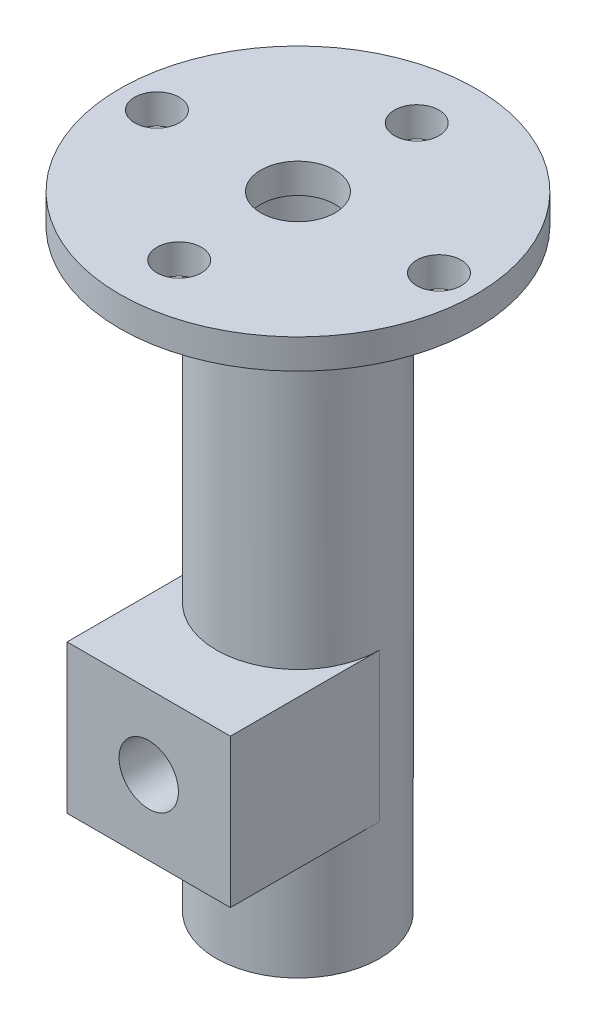
ISO-10303-21;
HEADER;
FILE_DESCRIPTION(('STEP AP214'),'2;1');
FILE_NAME('part.step','',(''),(''),'','','');
FILE_SCHEMA(('AUTOMOTIVE_DESIGN { 1 0 10303 214 1 1 1 1 }'));
ENDSEC;
DATA;
#1=APPLICATION_CONTEXT('core data for automotive mechanical design processes');
#2=APPLICATION_PROTOCOL_DEFINITION('international standard','automotive_design',2000,#1);
#3=PRODUCT_CONTEXT('',#1,'mechanical');
#4=PRODUCT('Part','Part','',(#3));
#5=PRODUCT_RELATED_PRODUCT_CATEGORY('part','',(#4));
#6=PRODUCT_DEFINITION_FORMATION('','',#4);
#7=PRODUCT_DEFINITION_CONTEXT('part definition',#1,'design');
#8=PRODUCT_DEFINITION('design','',#6,#7);
#9=PRODUCT_DEFINITION_SHAPE('','',#8);
#10=(LENGTH_UNIT() NAMED_UNIT(*) SI_UNIT(.MILLI.,.METRE.));
#11=(NAMED_UNIT(*) PLANE_ANGLE_UNIT() SI_UNIT($,.RADIAN.));
#12=(NAMED_UNIT(*) SI_UNIT($,.STERADIAN.) SOLID_ANGLE_UNIT());
#13=UNCERTAINTY_MEASURE_WITH_UNIT(LENGTH_MEASURE(1.E-05),#10,'distance_accuracy_value','');
#14=(GEOMETRIC_REPRESENTATION_CONTEXT(3) GLOBAL_UNCERTAINTY_ASSIGNED_CONTEXT((#13)) GLOBAL_UNIT_ASSIGNED_CONTEXT((#10,
#11,#12)) REPRESENTATION_CONTEXT('',''));
#15=CARTESIAN_POINT('',(0.,0.,0.));
#16=DIRECTION('',(0.,0.,1.));
#17=DIRECTION('',(1.,0.,0.));
#18=AXIS2_PLACEMENT_3D('',#15,#16,#17);
#19=CARTESIAN_POINT('',(0.,26.,0.));
#20=DIRECTION('',(0.,1.,0.));
#21=DIRECTION('',(0.,0.,1.));
#22=AXIS2_PLACEMENT_3D('',#19,#20,#21);
#23=PLANE('',#22);
#24=CARTESIAN_POINT('',(0.,26.,0.));
#25=DIRECTION('',(0.,-1.,0.));
#26=DIRECTION('',(0.,0.,-1.));
#27=AXIS2_PLACEMENT_3D('',#24,#25,#26);
#28=CIRCLE('',#27,2.5);
#29=CARTESIAN_POINT('',(0.,26.,-2.5));
#30=VERTEX_POINT('',#29);
#31=EDGE_CURVE('E162',#30,#30,#28,.T.);
#32=ORIENTED_EDGE('',*,*,#31,.F.);
#33=EDGE_LOOP('',(#32));
#34=FACE_BOUND('',#33,.T.);
#35=CARTESIAN_POINT('',(0.,26.,0.));
#36=DIRECTION('',(0.,-1.,0.));
#37=DIRECTION('',(0.,0.,-1.));
#38=AXIS2_PLACEMENT_3D('',#35,#36,#37);
#39=CIRCLE('',#38,4.05);
#40=CARTESIAN_POINT('',(0.,26.,-4.05));
#41=VERTEX_POINT('',#40);
#42=EDGE_CURVE('E147',#41,#41,#39,.T.);
#43=ORIENTED_EDGE('',*,*,#42,.T.);
#44=EDGE_LOOP('',(#43));
#45=FACE_BOUND('',#44,.T.);
#46=ADVANCED_FACE('F51',(#34,#45),#23,.F.);
#47=CARTESIAN_POINT('',(-9.5,26.,0.));
#48=DIRECTION('',(0.,-1.,0.));
#49=DIRECTION('',(0.,0.,-1.));
#50=AXIS2_PLACEMENT_3D('',#47,#48,#49);
#51=CIRCLE('',#50,1.5);
#52=CARTESIAN_POINT('',(-9.5,26.,-1.5));
#53=VERTEX_POINT('',#52);
#54=EDGE_CURVE('E175',#53,#53,#51,.F.);
#55=ORIENTED_EDGE('',*,*,#54,.T.);
#56=EDGE_LOOP('',(#55));
#57=FACE_BOUND('',#56,.T.);
#58=CARTESIAN_POINT('',(0.,26.,8.));
#59=DIRECTION('',(0.,-1.,0.));
#60=DIRECTION('',(0.,0.,-1.));
#61=AXIS2_PLACEMENT_3D('',#58,#59,#60);
#62=CIRCLE('',#61,1.5);
#63=CARTESIAN_POINT('',(0.,26.,6.5));
#64=VERTEX_POINT('',#63);
#65=EDGE_CURVE('E170',#64,#64,#62,.T.);
#66=ORIENTED_EDGE('',*,*,#65,.F.);
#67=CARTESIAN_POINT('',(0.,26.,0.));
#68=DIRECTION('',(0.,1.,0.));
#69=DIRECTION('',(0.,0.,1.));
#70=AXIS2_PLACEMENT_3D('',#67,#68,#69);
#71=CIRCLE('',#70,6.49999999999999);
#72=CARTESIAN_POINT('',(0.,26.,-6.5));
#73=VERTEX_POINT('',#72);
#74=EDGE_CURVE('E11',#64,#73,#71,.T.);
#75=ORIENTED_EDGE('',*,*,#74,.T.);
#76=CARTESIAN_POINT('',(0.,26.,-8.));
#77=DIRECTION('',(0.,-1.,0.));
#78=DIRECTION('',(0.,0.,-1.));
#79=AXIS2_PLACEMENT_3D('',#76,#77,#78);
#80=CIRCLE('',#79,1.5);
#81=EDGE_CURVE('E182',#73,#73,#80,.F.);
#82=ORIENTED_EDGE('',*,*,#81,.T.);
#83=CARTESIAN_POINT('',(0.,26.,0.));
#84=DIRECTION('',(0.,1.,0.));
#85=DIRECTION('',(0.,0.,1.));
#86=AXIS2_PLACEMENT_3D('',#83,#84,#85);
#87=CIRCLE('',#86,6.49999999999999);
#88=EDGE_CURVE('E61',#73,#64,#87,.T.);
#89=ORIENTED_EDGE('',*,*,#88,.T.);
#90=EDGE_LOOP('',(#66,#75,#82,#89));
#91=FACE_BOUND('',#90,.T.);
#92=CARTESIAN_POINT('',(9.5,26.,0.));
#93=DIRECTION('',(0.,-1.,0.));
#94=DIRECTION('',(0.,0.,-1.));
#95=AXIS2_PLACEMENT_3D('',#92,#93,#94);
#96=CIRCLE('',#95,1.5);
#97=CARTESIAN_POINT('',(9.5,26.,-1.5));
#98=VERTEX_POINT('',#97);
#99=EDGE_CURVE('E188',#98,#98,#96,.T.);
#100=ORIENTED_EDGE('',*,*,#99,.F.);
#101=EDGE_LOOP('',(#100));
#102=FACE_BOUND('',#101,.T.);
#103=CARTESIAN_POINT('',(0.,26.,0.));
#104=DIRECTION('',(0.,1.,0.));
#105=DIRECTION('',(0.,0.,1.));
#106=AXIS2_PLACEMENT_3D('',#103,#104,#105);
#107=CIRCLE('',#106,12.);
#108=CARTESIAN_POINT('',(0.,26.,12.));
#109=VERTEX_POINT('',#108);
#110=EDGE_CURVE('E158',#109,#109,#107,.T.);
#111=ORIENTED_EDGE('',*,*,#110,.F.);
#112=EDGE_LOOP('',(#111));
#113=FACE_BOUND('',#112,.T.);
#114=ADVANCED_FACE('F211',(#57,#91,#102,#113),#23,.F.);
#115=CARTESIAN_POINT('',(0.,28.,0.));
#116=DIRECTION('',(0.,1.,0.));
#117=DIRECTION('',(0.,0.,1.));
#118=AXIS2_PLACEMENT_3D('',#115,#116,#117);
#119=PLANE('',#118);
#120=CARTESIAN_POINT('',(-9.5,28.,0.));
#121=DIRECTION('',(0.,-1.,0.));
#122=DIRECTION('',(0.,0.,-1.));
#123=AXIS2_PLACEMENT_3D('',#120,#121,#122);
#124=CIRCLE('',#123,1.5);
#125=CARTESIAN_POINT('',(-9.5,28.,-1.5));
#126=VERTEX_POINT('',#125);
#127=EDGE_CURVE('E172',#126,#126,#124,.F.);
#128=ORIENTED_EDGE('',*,*,#127,.F.);
#129=EDGE_LOOP('',(#128));
#130=FACE_BOUND('',#129,.T.);
#131=CARTESIAN_POINT('',(9.5,28.,0.));
#132=DIRECTION('',(0.,-1.,0.));
#133=DIRECTION('',(0.,0.,-1.));
#134=AXIS2_PLACEMENT_3D('',#131,#132,#133);
#135=CIRCLE('',#134,1.5);
#136=CARTESIAN_POINT('',(9.5,28.,-1.5));
#137=VERTEX_POINT('',#136);
#138=EDGE_CURVE('E185',#137,#137,#135,.T.);
#139=ORIENTED_EDGE('',*,*,#138,.T.);
#140=EDGE_LOOP('',(#139));
#141=FACE_BOUND('',#140,.T.);
#142=CARTESIAN_POINT('',(0.,28.,-8.));
#143=DIRECTION('',(0.,-1.,0.));
#144=DIRECTION('',(0.,0.,-1.));
#145=AXIS2_PLACEMENT_3D('',#142,#143,#144);
#146=CIRCLE('',#145,1.5);
#147=CARTESIAN_POINT('',(0.,28.,-9.5));
#148=VERTEX_POINT('',#147);
#149=EDGE_CURVE('E178',#148,#148,#146,.F.);
#150=ORIENTED_EDGE('',*,*,#149,.F.);
#151=EDGE_LOOP('',(#150));
#152=FACE_BOUND('',#151,.T.);
#153=CARTESIAN_POINT('',(0.,28.,8.));
#154=DIRECTION('',(0.,-1.,0.));
#155=DIRECTION('',(0.,0.,-1.));
#156=AXIS2_PLACEMENT_3D('',#153,#154,#155);
#157=CIRCLE('',#156,1.5);
#158=CARTESIAN_POINT('',(0.,28.,6.5));
#159=VERTEX_POINT('',#158);
#160=EDGE_CURVE('E166',#159,#159,#157,.T.);
#161=ORIENTED_EDGE('',*,*,#160,.T.);
#162=EDGE_LOOP('',(#161));
#163=FACE_BOUND('',#162,.T.);
#164=CARTESIAN_POINT('',(0.,28.,0.));
#165=DIRECTION('',(0.,1.,0.));
#166=DIRECTION('',(0.,0.,1.));
#167=AXIS2_PLACEMENT_3D('',#164,#165,#166);
#168=CIRCLE('',#167,2.5);
#169=CARTESIAN_POINT('',(0.,28.,2.5));
#170=VERTEX_POINT('',#169);
#171=EDGE_CURVE('E165',#170,#170,#168,.T.);
#172=ORIENTED_EDGE('',*,*,#171,.F.);
#173=EDGE_LOOP('',(#172));
#174=FACE_BOUND('',#173,.T.);
#175=CARTESIAN_POINT('',(0.,28.,0.));
#176=DIRECTION('',(0.,1.,0.));
#177=DIRECTION('',(0.,0.,1.));
#178=AXIS2_PLACEMENT_3D('',#175,#176,#177);
#179=CIRCLE('',#178,12.);
#180=CARTESIAN_POINT('',(0.,28.,12.));
#181=VERTEX_POINT('',#180);
#182=EDGE_CURVE('E157',#181,#181,#179,.T.);
#183=ORIENTED_EDGE('',*,*,#182,.T.);
#184=EDGE_LOOP('',(#183));
#185=FACE_BOUND('',#184,.T.);
#186=ADVANCED_FACE('F218',(#130,#141,#152,#163,#174,#185),#119,.T.);
#187=CARTESIAN_POINT('',(9.5,28.,0.));
#188=DIRECTION('',(0.,-1.,0.));
#189=DIRECTION('',(0.,0.,-1.));
#190=AXIS2_PLACEMENT_3D('',#187,#188,#189);
#191=CYLINDRICAL_SURFACE('',#190,1.5);
#192=ORIENTED_EDGE('',*,*,#138,.F.);
#193=EDGE_LOOP('',(#192));
#194=FACE_BOUND('',#193,.T.);
#195=ORIENTED_EDGE('',*,*,#99,.T.);
#196=EDGE_LOOP('',(#195));
#197=FACE_BOUND('',#196,.T.);
#198=ADVANCED_FACE('F225',(#194,#197),#191,.F.);
#199=CARTESIAN_POINT('',(0.,28.,-8.));
#200=DIRECTION('',(0.,-1.,0.));
#201=DIRECTION('',(0.,0.,-1.));
#202=AXIS2_PLACEMENT_3D('',#199,#200,#201);
#203=CYLINDRICAL_SURFACE('',#202,1.5);
#204=ORIENTED_EDGE('',*,*,#149,.T.);
#205=EDGE_LOOP('',(#204));
#206=FACE_BOUND('',#205,.T.);
#207=ORIENTED_EDGE('',*,*,#81,.F.);
#208=EDGE_LOOP('',(#207));
#209=FACE_BOUND('',#208,.T.);
#210=ADVANCED_FACE('F229',(#206,#209),#203,.F.);
#211=CARTESIAN_POINT('',(-9.5,28.,0.));
#212=DIRECTION('',(0.,-1.,0.));
#213=DIRECTION('',(0.,0.,-1.));
#214=AXIS2_PLACEMENT_3D('',#211,#212,#213);
#215=CYLINDRICAL_SURFACE('',#214,1.5);
#216=ORIENTED_EDGE('',*,*,#127,.T.);
#217=EDGE_LOOP('',(#216));
#218=FACE_BOUND('',#217,.T.);
#219=ORIENTED_EDGE('',*,*,#54,.F.);
#220=EDGE_LOOP('',(#219));
#221=FACE_BOUND('',#220,.T.);
#222=ADVANCED_FACE('F233',(#218,#221),#215,.F.);
#223=CARTESIAN_POINT('',(0.,28.,8.));
#224=DIRECTION('',(0.,-1.,0.));
#225=DIRECTION('',(0.,0.,-1.));
#226=AXIS2_PLACEMENT_3D('',#223,#224,#225);
#227=CYLINDRICAL_SURFACE('',#226,1.5);
#228=ORIENTED_EDGE('',*,*,#160,.F.);
#229=EDGE_LOOP('',(#228));
#230=FACE_BOUND('',#229,.T.);
#231=ORIENTED_EDGE('',*,*,#65,.T.);
#232=EDGE_LOOP('',(#231));
#233=FACE_BOUND('',#232,.T.);
#234=ADVANCED_FACE('F237',(#230,#233),#227,.F.);
#235=CARTESIAN_POINT('',(0.,36.,0.));
#236=DIRECTION('',(0.,-1.,0.));
#237=DIRECTION('',(0.,0.,-1.));
#238=AXIS2_PLACEMENT_3D('',#235,#236,#237);
#239=CYLINDRICAL_SURFACE('',#238,2.5);
#240=ORIENTED_EDGE('',*,*,#171,.T.);
#241=EDGE_LOOP('',(#240));
#242=FACE_BOUND('',#241,.T.);
#243=ORIENTED_EDGE('',*,*,#31,.T.);
#244=EDGE_LOOP('',(#243));
#245=FACE_BOUND('',#244,.T.);
#246=ADVANCED_FACE('F241',(#242,#245),#239,.F.);
#247=CARTESIAN_POINT('',(0.,44.,0.));
#248=DIRECTION('',(0.,-1.,0.));
#249=DIRECTION('',(0.,0.,-1.));
#250=AXIS2_PLACEMENT_3D('',#247,#248,#249);
#251=CYLINDRICAL_SURFACE('',#250,12.);
#252=ORIENTED_EDGE('',*,*,#182,.F.);
#253=EDGE_LOOP('',(#252));
#254=FACE_BOUND('',#253,.T.);
#255=ORIENTED_EDGE('',*,*,#110,.T.);
#256=EDGE_LOOP('',(#255));
#257=FACE_BOUND('',#256,.T.);
#258=ADVANCED_FACE('F245',(#254,#257),#251,.T.);
#259=CARTESIAN_POINT('',(0.,-14.,0.));
#260=DIRECTION('',(0.,-1.,0.));
#261=DIRECTION('',(0.,0.,-1.));
#262=AXIS2_PLACEMENT_3D('',#259,#260,#261);
#263=PLANE('',#262);
#264=CARTESIAN_POINT('',(0.,-14.,0.));
#265=DIRECTION('',(0.,-1.,0.));
#266=DIRECTION('',(0.,0.,-1.));
#267=AXIS2_PLACEMENT_3D('',#264,#265,#266);
#268=CIRCLE('',#267,5.5);
#269=CARTESIAN_POINT('',(0.,-14.,-5.5));
#270=VERTEX_POINT('',#269);
#271=EDGE_CURVE('E151',#270,#270,#268,.T.);
#272=ORIENTED_EDGE('',*,*,#271,.T.);
#273=EDGE_LOOP('',(#272));
#274=FACE_BOUND('',#273,.T.);
#275=CARTESIAN_POINT('',(0.,-14.,0.));
#276=DIRECTION('',(0.,-1.,0.));
#277=DIRECTION('',(0.,0.,-1.));
#278=AXIS2_PLACEMENT_3D('',#275,#276,#277);
#279=CIRCLE('',#278,4.05);
#280=CARTESIAN_POINT('',(0.,-14.,-4.05));
#281=VERTEX_POINT('',#280);
#282=EDGE_CURVE('E148',#281,#281,#279,.T.);
#283=ORIENTED_EDGE('',*,*,#282,.F.);
#284=EDGE_LOOP('',(#283));
#285=FACE_BOUND('',#284,.T.);
#286=ADVANCED_FACE('F248',(#274,#285),#263,.T.);
#287=CARTESIAN_POINT('',(0.,-14.,0.));
#288=DIRECTION('',(0.,1.,0.));
#289=DIRECTION('',(0.,0.,1.));
#290=AXIS2_PLACEMENT_3D('',#287,#288,#289);
#291=CYLINDRICAL_SURFACE('',#290,5.5);
#292=CARTESIAN_POINT('',(0.,25.,0.));
#293=DIRECTION('',(0.,1.,0.));
#294=DIRECTION('',(0.,0.,1.));
#295=AXIS2_PLACEMENT_3D('',#292,#293,#294);
#296=CIRCLE('',#295,5.5);
#297=CARTESIAN_POINT('',(0.,25.,5.5));
#298=VERTEX_POINT('',#297);
#299=EDGE_CURVE('E169',#298,#298,#296,.F.);
#300=ORIENTED_EDGE('',*,*,#299,.T.);
#301=EDGE_LOOP('',(#300));
#302=FACE_BOUND('',#301,.T.);
#303=DIRECTION('',(0.,1.,0.));
#304=VECTOR('',#303,1.);
#305=CARTESIAN_POINT('',(5.5,-6.,0.));
#306=LINE('',#305,#304);
#307=CARTESIAN_POINT('',(5.5,-6.,0.));
#308=VERTEX_POINT('',#307);
#309=CARTESIAN_POINT('',(5.5,4.,0.));
#310=VERTEX_POINT('',#309);
#311=EDGE_CURVE('E105',#308,#310,#306,.T.);
#312=ORIENTED_EDGE('',*,*,#311,.F.);
#313=CARTESIAN_POINT('',(0.,-6.,0.));
#314=DIRECTION('',(0.,-1.,0.));
#315=DIRECTION('',(0.,0.,-1.));
#316=AXIS2_PLACEMENT_3D('',#313,#314,#315);
#317=CIRCLE('',#316,5.5);
#318=CARTESIAN_POINT('',(-5.5,-6.,0.));
#319=VERTEX_POINT('',#318);
#320=EDGE_CURVE('E144',#308,#319,#317,.T.);
#321=ORIENTED_EDGE('',*,*,#320,.T.);
#322=DIRECTION('',(0.,-1.,0.));
#323=VECTOR('',#322,1.);
#324=CARTESIAN_POINT('',(-5.5,-6.,0.));
#325=LINE('',#324,#323);
#326=CARTESIAN_POINT('',(-5.5,4.,0.));
#327=VERTEX_POINT('',#326);
#328=EDGE_CURVE('E109',#327,#319,#325,.T.);
#329=ORIENTED_EDGE('',*,*,#328,.F.);
#330=CARTESIAN_POINT('',(0.,4.,0.));
#331=DIRECTION('',(0.,1.,0.));
#332=DIRECTION('',(0.,0.,1.));
#333=AXIS2_PLACEMENT_3D('',#330,#331,#332);
#334=CIRCLE('',#333,5.5);
#335=EDGE_CURVE('E139',#327,#310,#334,.T.);
#336=ORIENTED_EDGE('',*,*,#335,.T.);
#337=EDGE_LOOP('',(#312,#321,#329,#336));
#338=FACE_BOUND('',#337,.T.);
#339=ORIENTED_EDGE('',*,*,#271,.F.);
#340=EDGE_LOOP('',(#339));
#341=FACE_BOUND('',#340,.T.);
#342=ADVANCED_FACE('F201',(#302,#338,#341),#291,.T.);
#343=CARTESIAN_POINT('',(0.,-14.,0.));
#344=DIRECTION('',(0.,1.,0.));
#345=DIRECTION('',(0.,0.,1.));
#346=AXIS2_PLACEMENT_3D('',#343,#344,#345);
#347=CYLINDRICAL_SURFACE('',#346,4.05);
#348=CARTESIAN_POINT('',(0.,-3.,4.05));
#349=CARTESIAN_POINT('',(-0.105298985674217,-2.99999350466129,4.04999439467187));
#350=CARTESIAN_POINT('',(-0.210728129267288,-2.99163518962031,4.04584909869586));
#351=CARTESIAN_POINT('',(-0.418480201896479,-2.95856695929076,4.02967546969412));
#352=CARTESIAN_POINT('',(-0.520796628944081,-2.93382498621512,4.01763168219131));
#353=CARTESIAN_POINT('',(-0.718998989278564,-2.86918789730578,3.98692370572068));
#354=CARTESIAN_POINT('',(-0.814908050336162,-2.82935118053624,3.96828504938014));
#355=CARTESIAN_POINT('',(-0.998543838189898,-2.73595276806572,3.92610487297356));
#356=CARTESIAN_POINT('',(-1.08627134131768,-2.6823923763878,3.90256381877295));
#357=CARTESIAN_POINT('',(-1.25692045806399,-2.55944184724297,3.85111135588415));
#358=CARTESIAN_POINT('',(-1.33924648885804,-2.48930004356778,3.82302334968899));
#359=CARTESIAN_POINT('',(-1.49151271542499,-2.33679308011901,3.76623236790133));
#360=CARTESIAN_POINT('',(-1.56144372115939,-2.25441893339509,3.73752895355516));
#361=CARTESIAN_POINT('',(-1.6922002062382,-2.07235271130753,3.68027586126372));
#362=CARTESIAN_POINT('',(-1.75194615808596,-1.97182432539081,3.6518999104567));
#363=CARTESIAN_POINT('',(-1.85342998530181,-1.76059101100199,3.60146226420581));
#364=CARTESIAN_POINT('',(-1.89518048785736,-1.64989328461553,3.57939614490139));
#365=CARTESIAN_POINT('',(-1.95681189900023,-1.42816286616237,3.54606223605946));
#366=CARTESIAN_POINT('',(-1.9778413178193,-1.31753807946913,3.5342324463004));
#367=CARTESIAN_POINT('',(-2.00095777331023,-1.0937499500578,3.52120217907533));
#368=CARTESIAN_POINT('',(-2.0030627147404,-0.98058910840734,3.51999165457469));
#369=CARTESIAN_POINT('',(-1.98911437922581,-0.769038507313337,3.52788247731484));
#370=CARTESIAN_POINT('',(-1.97513798607685,-0.67045725076822,3.53580458650969));
#371=CARTESIAN_POINT('',(-1.93301285362725,-0.477276935966634,3.55900739380011));
#372=CARTESIAN_POINT('',(-1.90485978160821,-0.382679104719894,3.57429034147465));
#373=CARTESIAN_POINT('',(-1.83465761880947,-0.197456391279119,3.61083386594271));
#374=CARTESIAN_POINT('',(-1.79229976522945,-0.10697561461433,3.63222553733338));
#375=CARTESIAN_POINT('',(-1.69512502467436,0.0660234301313618,3.67857936582601));
#376=CARTESIAN_POINT('',(-1.64030255419728,0.148538106141912,3.70354312117317));
#377=CARTESIAN_POINT('',(-1.5118694612167,0.313972558193445,3.7579496930696));
#378=CARTESIAN_POINT('',(-1.43677580945809,0.395688161720353,3.78756528524018));
#379=CARTESIAN_POINT('',(-1.27381309668064,0.545860373625007,3.84543594547626));
#380=CARTESIAN_POINT('',(-1.18593824607445,0.614310940298732,3.87369038921041));
#381=CARTESIAN_POINT('',(-0.994968090871408,0.73884741012441,3.9271855007238));
#382=CARTESIAN_POINT('',(-0.89137120497815,0.794251798203382,3.95223738071584));
#383=CARTESIAN_POINT('',(-0.674775734154898,0.886398118100003,3.99491203427813));
#384=CARTESIAN_POINT('',(-0.561784520863995,0.92315452491769,4.01254056821105));
#385=CARTESIAN_POINT('',(-0.339478056237033,0.974000709342287,4.03716841504458));
#386=CARTESIAN_POINT('',(-0.230612985379017,0.989692829396558,4.04491652443614));
#387=CARTESIAN_POINT('',(-0.0115347360559976,1.00297100495429,4.05146319118799));
#388=CARTESIAN_POINT('',(0.0986778039503413,1.00056532711684,4.05026583463371));
#389=CARTESIAN_POINT('',(0.308517233422822,0.978662963799938,4.03949656697111));
#390=CARTESIAN_POINT('',(0.408316972441017,0.960464937019168,4.0305611006872));
#391=CARTESIAN_POINT('',(0.603252439176691,0.909512753663673,4.00602569516312));
#392=CARTESIAN_POINT('',(0.698387645654574,0.876756974425956,3.99042501299991));
#393=CARTESIAN_POINT('',(0.884489633972913,0.796730233862777,3.95340953749898));
#394=CARTESIAN_POINT('',(0.975254656454013,0.749064752805984,3.93183881653701));
#395=CARTESIAN_POINT('',(1.14780324979968,0.641012699996766,3.88497799965267));
#396=CARTESIAN_POINT('',(1.22958293334745,0.580620655077647,3.85968630491112));
#397=CARTESIAN_POINT('',(1.39018840176861,0.442108741917982,3.80496363002897));
#398=CARTESIAN_POINT('',(1.46797070139015,0.362841537666325,3.77536860853608));
#399=CARTESIAN_POINT('',(1.60958696682357,0.192278578878282,3.71720363594439));
#400=CARTESIAN_POINT('',(1.67341186789061,0.100975068589723,3.68863436103108));
#401=CARTESIAN_POINT('',(1.7879985128165,-0.0963147987573915,3.6345238900404));
#402=CARTESIAN_POINT('',(1.83803873111535,-0.202778513714969,3.60917813211786));
#403=CARTESIAN_POINT('',(1.91895687523151,-0.424274251714075,3.56682242036118));
#404=CARTESIAN_POINT('',(1.94985888610984,-0.5392953003739,3.54980199495498));
#405=CARTESIAN_POINT('',(1.9888239502445,-0.762918405716968,3.52810600541317));
#406=CARTESIAN_POINT('',(1.99878056976135,-0.871089690886225,3.52240980896923));
#407=CARTESIAN_POINT('',(2.00100667413743,-1.08765483821797,3.52114767272606));
#408=CARTESIAN_POINT('',(1.99328322177357,-1.19604859422552,3.5255776877402));
#409=CARTESIAN_POINT('',(1.96212749092883,-1.39961741391744,3.54299598655469));
#410=CARTESIAN_POINT('',(1.94018566540543,-1.49509891070029,3.55517042889123));
#411=CARTESIAN_POINT('',(1.88302633433742,-1.6809325550968,3.58577138587535));
#412=CARTESIAN_POINT('',(1.84780463586186,-1.77128307229895,3.60419987496543));
#413=CARTESIAN_POINT('',(1.76242550286895,-1.95100634749117,3.64674811273839));
#414=CARTESIAN_POINT('',(1.71142287933378,-2.03990466694403,3.67116727136272));
#415=CARTESIAN_POINT('',(1.59688037713523,-2.20845686390471,3.72241978510133));
#416=CARTESIAN_POINT('',(1.53333407099836,-2.28810596867637,3.74925437404864));
#417=CARTESIAN_POINT('',(1.38674963882167,-2.44561906013012,3.80608711818777));
#418=CARTESIAN_POINT('',(1.30229887587988,-2.52217505838334,3.836086724706));
#419=CARTESIAN_POINT('',(1.12088417957822,-2.66030571528056,3.89296133383178));
#420=CARTESIAN_POINT('',(1.02391373063061,-2.72187252465398,3.91983469551371));
#421=CARTESIAN_POINT('',(0.819198985742743,-2.82818885123645,3.96768301959672));
#422=CARTESIAN_POINT('',(0.711408833409011,-2.87286260480669,3.98863130533684));
#423=CARTESIAN_POINT('',(0.488647087387672,-2.94287666406422,4.02197830006133));
#424=CARTESIAN_POINT('',(0.373697136704364,-2.96827244185711,4.03440152979437));
#425=CARTESIAN_POINT('',(0.214674876098527,-2.98891261633855,4.04453461053542));
#426=CARTESIAN_POINT('',(0.171878737289999,-2.99306479029572,4.04657904392334));
#427=CARTESIAN_POINT('',(0.0860623188398581,-2.9986098471879,4.04931290270966));
#428=CARTESIAN_POINT('',(0.0430420331307653,-3.00000265503587,4.05000229123498));
#429=CARTESIAN_POINT('',(0.,-3.,4.05));
#430=B_SPLINE_CURVE_WITH_KNOTS('',3,(#348,#349,#350,#351,#352,#353,#354,#355,#356,#357,#358,
#359,#360,#361,#362,#363,#364,#365,#366,#367,#368,#369,#370,#371,#372,#373,#374,#375,#376,#377,
#378,#379,#380,#381,#382,#383,#384,#385,#386,#387,#388,#389,#390,#391,#392,#393,#394,#395,#396,
#397,#398,#399,#400,#401,#402,#403,#404,#405,#406,#407,#408,#409,#410,#411,#412,#413,#414,#415,
#416,#417,#418,#419,#420,#421,#422,#423,#424,#425,#426,#427,#428,#429),.UNSPECIFIED.,.T.,.F.,(4,
2,2,2,2,2,2,2,2,2,2,2,2,2,2,2,2,2,2,2,2,2,2,2,2,2,2,2,2,2,2,2,2,2,2,2,2,2,2,2,4),(0.,
0.315722089010298,0.632063781901605,0.947193894565555,1.26229407467559,1.59612317902559,
1.93019876813084,2.28938542138593,2.64831962580698,2.9860017284999,3.32336431095921,
3.62161470310596,3.9199563027902,4.22525565332119,4.53069203251425,4.87378350665418,
5.21703088012003,5.57547343749796,5.93363733603171,6.26262897252918,6.59147034231865,
6.8955864074757,7.19973637908215,7.51273387907547,7.82586626200878,8.16916376122694,
8.51268355994386,8.8717427466058,9.23034914114487,9.55482966482331,9.87918058871205,
10.1740725925722,10.4690577824632,10.7838822623483,11.0988684812991,11.4508437839781,
11.8030030082505,12.1567234091897,12.5094220855276,12.6384731941867,12.7675278144975),.UNSPECIFIED.);
#431=CARTESIAN_POINT('',(0.,-3.,4.05));
#432=VERTEX_POINT('',#431);
#433=EDGE_CURVE('E128',#432,#432,#430,.T.);
#434=ORIENTED_EDGE('',*,*,#433,.F.);
#435=EDGE_LOOP('',(#434));
#436=FACE_BOUND('',#435,.T.);
#437=ORIENTED_EDGE('',*,*,#282,.T.);
#438=EDGE_LOOP('',(#437));
#439=FACE_BOUND('',#438,.T.);
#440=ORIENTED_EDGE('',*,*,#42,.F.);
#441=EDGE_LOOP('',(#440));
#442=FACE_BOUND('',#441,.T.);
#443=ADVANCED_FACE('F252',(#436,#439,#442),#347,.F.);
#444=CARTESIAN_POINT('',(0.,-1.,0.));
#445=DIRECTION('',(0.,0.,1.));
#446=DIRECTION('',(1.,0.,0.));
#447=AXIS2_PLACEMENT_3D('',#444,#445,#446);
#448=CYLINDRICAL_SURFACE('',#447,2.);
#449=CARTESIAN_POINT('',(0.,-1.,10.05));
#450=DIRECTION('',(0.,0.,1.));
#451=DIRECTION('',(1.,0.,0.));
#452=AXIS2_PLACEMENT_3D('',#449,#450,#451);
#453=CIRCLE('',#452,2.);
#454=CARTESIAN_POINT('',(2.,-1.,10.05));
#455=VERTEX_POINT('',#454);
#456=EDGE_CURVE('E125',#455,#455,#453,.T.);
#457=ORIENTED_EDGE('',*,*,#456,.T.);
#458=EDGE_LOOP('',(#457));
#459=FACE_BOUND('',#458,.T.);
#460=ORIENTED_EDGE('',*,*,#433,.T.);
#461=EDGE_LOOP('',(#460));
#462=FACE_BOUND('',#461,.T.);
#463=ADVANCED_FACE('F258',(#459,#462),#448,.F.);
#464=CARTESIAN_POINT('',(5.5,-6.,0.));
#465=DIRECTION('',(1.,0.,0.));
#466=DIRECTION('',(0.,0.,-1.));
#467=AXIS2_PLACEMENT_3D('',#464,#465,#466);
#468=PLANE('',#467);
#469=DIRECTION('',(0.,0.,1.));
#470=VECTOR('',#469,1.);
#471=CARTESIAN_POINT('',(5.5,4.,0.));
#472=LINE('',#471,#470);
#473=CARTESIAN_POINT('',(5.5,4.,10.05));
#474=VERTEX_POINT('',#473);
#475=EDGE_CURVE('E99',#310,#474,#472,.T.);
#476=ORIENTED_EDGE('',*,*,#475,.T.);
#477=DIRECTION('',(0.,1.,0.));
#478=VECTOR('',#477,1.);
#479=CARTESIAN_POINT('',(5.5,-6.,10.05));
#480=LINE('',#479,#478);
#481=CARTESIAN_POINT('',(5.5,-6.,10.05));
#482=VERTEX_POINT('',#481);
#483=EDGE_CURVE('E103',#482,#474,#480,.T.);
#484=ORIENTED_EDGE('',*,*,#483,.F.);
#485=DIRECTION('',(0.,0.,1.));
#486=VECTOR('',#485,1.);
#487=CARTESIAN_POINT('',(5.5,-6.,0.));
#488=LINE('',#487,#486);
#489=EDGE_CURVE('E137',#308,#482,#488,.T.);
#490=ORIENTED_EDGE('',*,*,#489,.F.);
#491=ORIENTED_EDGE('',*,*,#311,.T.);
#492=EDGE_LOOP('',(#476,#484,#490,#491));
#493=FACE_BOUND('',#492,.T.);
#494=ADVANCED_FACE('F101',(#493),#468,.T.);
#495=CARTESIAN_POINT('',(-5.5,-6.,0.));
#496=DIRECTION('',(0.,-1.,0.));
#497=DIRECTION('',(0.,0.,-1.));
#498=AXIS2_PLACEMENT_3D('',#495,#496,#497);
#499=PLANE('',#498);
#500=ORIENTED_EDGE('',*,*,#320,.F.);
#501=ORIENTED_EDGE('',*,*,#489,.T.);
#502=DIRECTION('',(1.,0.,0.));
#503=VECTOR('',#502,1.);
#504=CARTESIAN_POINT('',(-5.5,-6.,10.05));
#505=LINE('',#504,#503);
#506=CARTESIAN_POINT('',(-5.5,-6.,10.05));
#507=VERTEX_POINT('',#506);
#508=EDGE_CURVE('E124',#507,#482,#505,.T.);
#509=ORIENTED_EDGE('',*,*,#508,.F.);
#510=DIRECTION('',(0.,0.,1.));
#511=VECTOR('',#510,1.);
#512=CARTESIAN_POINT('',(-5.5,-6.,0.));
#513=LINE('',#512,#511);
#514=EDGE_CURVE('E140',#319,#507,#513,.T.);
#515=ORIENTED_EDGE('',*,*,#514,.F.);
#516=EDGE_LOOP('',(#500,#501,#509,#515));
#517=FACE_BOUND('',#516,.T.);
#518=ADVANCED_FACE('F271',(#517),#499,.T.);
#519=CARTESIAN_POINT('',(-5.5,-6.,0.));
#520=DIRECTION('',(-1.,0.,0.));
#521=DIRECTION('',(0.,0.,1.));
#522=AXIS2_PLACEMENT_3D('',#519,#520,#521);
#523=PLANE('',#522);
#524=ORIENTED_EDGE('',*,*,#514,.T.);
#525=DIRECTION('',(0.,-1.,0.));
#526=VECTOR('',#525,1.);
#527=CARTESIAN_POINT('',(-5.5,-6.,10.05));
#528=LINE('',#527,#526);
#529=CARTESIAN_POINT('',(-5.5,4.,10.05));
#530=VERTEX_POINT('',#529);
#531=EDGE_CURVE('E118',#530,#507,#528,.T.);
#532=ORIENTED_EDGE('',*,*,#531,.F.);
#533=DIRECTION('',(0.,0.,1.));
#534=VECTOR('',#533,1.);
#535=CARTESIAN_POINT('',(-5.5,4.,0.));
#536=LINE('',#535,#534);
#537=EDGE_CURVE('E108',#327,#530,#536,.T.);
#538=ORIENTED_EDGE('',*,*,#537,.F.);
#539=ORIENTED_EDGE('',*,*,#328,.T.);
#540=EDGE_LOOP('',(#524,#532,#538,#539));
#541=FACE_BOUND('',#540,.T.);
#542=ADVANCED_FACE('F274',(#541),#523,.T.);
#543=CARTESIAN_POINT('',(-5.5,4.,0.));
#544=DIRECTION('',(0.,1.,0.));
#545=DIRECTION('',(0.,0.,1.));
#546=AXIS2_PLACEMENT_3D('',#543,#544,#545);
#547=PLANE('',#546);
#548=ORIENTED_EDGE('',*,*,#335,.F.);
#549=ORIENTED_EDGE('',*,*,#537,.T.);
#550=DIRECTION('',(-1.,0.,0.));
#551=VECTOR('',#550,1.);
#552=CARTESIAN_POINT('',(-5.5,4.,10.05));
#553=LINE('',#552,#551);
#554=EDGE_CURVE('E112',#474,#530,#553,.T.);
#555=ORIENTED_EDGE('',*,*,#554,.F.);
#556=ORIENTED_EDGE('',*,*,#475,.F.);
#557=EDGE_LOOP('',(#548,#549,#555,#556));
#558=FACE_BOUND('',#557,.T.);
#559=ADVANCED_FACE('F113',(#558),#547,.T.);
#560=CARTESIAN_POINT('',(0.,0.,10.05));
#561=DIRECTION('',(0.,0.,-1.));
#562=DIRECTION('',(-1.,0.,0.));
#563=AXIS2_PLACEMENT_3D('',#560,#561,#562);
#564=PLANE('',#563);
#565=ORIENTED_EDGE('',*,*,#483,.T.);
#566=ORIENTED_EDGE('',*,*,#554,.T.);
#567=ORIENTED_EDGE('',*,*,#531,.T.);
#568=ORIENTED_EDGE('',*,*,#508,.T.);
#569=EDGE_LOOP('',(#565,#566,#567,#568));
#570=FACE_BOUND('',#569,.T.);
#571=ORIENTED_EDGE('',*,*,#456,.F.);
#572=EDGE_LOOP('',(#571));
#573=FACE_BOUND('',#572,.T.);
#574=ADVANCED_FACE('F121',(#570,#573),#564,.F.);
#575=CARTESIAN_POINT('',(0.,25.,0.));
#576=DIRECTION('',(0.,1.,0.));
#577=DIRECTION('',(0.,0.,1.));
#578=AXIS2_PLACEMENT_3D('',#575,#576,#577);
#579=CONICAL_SURFACE('',#578,5.5,0.785398163397447);
#580=ORIENTED_EDGE('',*,*,#88,.F.);
#581=ORIENTED_EDGE('',*,*,#74,.F.);
#582=EDGE_LOOP('',(#580,#581));
#583=FACE_BOUND('',#582,.T.);
#584=ORIENTED_EDGE('',*,*,#299,.F.);
#585=EDGE_LOOP('',(#584));
#586=FACE_BOUND('',#585,.T.);
#587=ADVANCED_FACE('F54',(#583,#586),#579,.T.);
#588=CLOSED_SHELL('',(#46,#114,#186,#198,#210,#222,#234,#246,#258,#286,#342,#443,#463,#494,#518,
#542,#559,#574,#587));
#589=MANIFOLD_SOLID_BREP('B2',#588);
#590=ADVANCED_BREP_SHAPE_REPRESENTATION('',(#18,#589),#14);
#591=SHAPE_DEFINITION_REPRESENTATION(#9,#590);
ENDSEC;
END-ISO-10303-21;
